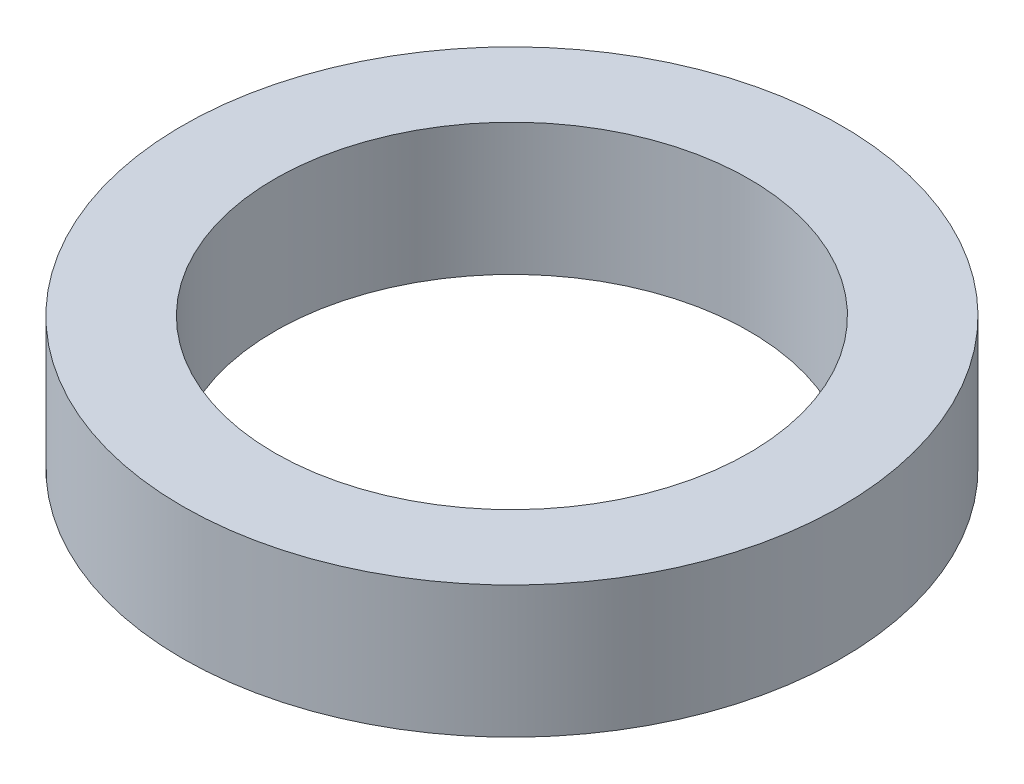
ISO-10303-21;
HEADER;
FILE_DESCRIPTION(('STEP AP214'),'2;1');
FILE_NAME('part.step','',(''),(''),'','','');
FILE_SCHEMA(('AUTOMOTIVE_DESIGN { 1 0 10303 214 1 1 1 1 }'));
ENDSEC;
DATA;
#1=APPLICATION_CONTEXT('core data for automotive mechanical design processes');
#2=APPLICATION_PROTOCOL_DEFINITION('international standard','automotive_design',2000,#1);
#3=PRODUCT_CONTEXT('',#1,'mechanical');
#4=PRODUCT('Part','Part','',(#3));
#5=PRODUCT_RELATED_PRODUCT_CATEGORY('part','',(#4));
#6=PRODUCT_DEFINITION_FORMATION('','',#4);
#7=PRODUCT_DEFINITION_CONTEXT('part definition',#1,'design');
#8=PRODUCT_DEFINITION('design','',#6,#7);
#9=PRODUCT_DEFINITION_SHAPE('','',#8);
#10=(LENGTH_UNIT() NAMED_UNIT(*) SI_UNIT(.MILLI.,.METRE.));
#11=(NAMED_UNIT(*) PLANE_ANGLE_UNIT() SI_UNIT($,.RADIAN.));
#12=(NAMED_UNIT(*) SI_UNIT($,.STERADIAN.) SOLID_ANGLE_UNIT());
#13=UNCERTAINTY_MEASURE_WITH_UNIT(LENGTH_MEASURE(1.E-05),#10,'distance_accuracy_value','');
#14=(GEOMETRIC_REPRESENTATION_CONTEXT(3) GLOBAL_UNCERTAINTY_ASSIGNED_CONTEXT((#13)) GLOBAL_UNIT_ASSIGNED_CONTEXT((#10,
#11,#12)) REPRESENTATION_CONTEXT('',''));
#15=CARTESIAN_POINT('',(0.,0.,0.));
#16=DIRECTION('',(0.,0.,1.));
#17=DIRECTION('',(1.,0.,0.));
#18=AXIS2_PLACEMENT_3D('',#15,#16,#17);
#19=CARTESIAN_POINT('',(0.,20.,0.));
#20=DIRECTION('',(0.,1.,0.));
#21=DIRECTION('',(0.,0.,1.));
#22=AXIS2_PLACEMENT_3D('',#19,#20,#21);
#23=PLANE('',#22);
#24=CARTESIAN_POINT('',(0.,20.,0.));
#25=DIRECTION('',(0.,1.,0.));
#26=DIRECTION('',(0.,0.,1.));
#27=AXIS2_PLACEMENT_3D('',#24,#25,#26);
#28=CIRCLE('',#27,36.);
#29=CARTESIAN_POINT('',(0.,20.,36.));
#30=VERTEX_POINT('',#29);
#31=EDGE_CURVE('E27',#30,#30,#28,.F.);
#32=ORIENTED_EDGE('',*,*,#31,.T.);
#33=EDGE_LOOP('',(#32));
#34=FACE_BOUND('',#33,.T.);
#35=CARTESIAN_POINT('',(0.,20.,0.));
#36=DIRECTION('',(0.,1.,0.));
#37=DIRECTION('',(0.,0.,1.));
#38=AXIS2_PLACEMENT_3D('',#35,#36,#37);
#39=CIRCLE('',#38,50.);
#40=CARTESIAN_POINT('',(0.,20.,50.));
#41=VERTEX_POINT('',#40);
#42=EDGE_CURVE('E18',#41,#41,#39,.F.);
#43=ORIENTED_EDGE('',*,*,#42,.F.);
#44=EDGE_LOOP('',(#43));
#45=FACE_BOUND('',#44,.T.);
#46=ADVANCED_FACE('F15',(#34,#45),#23,.T.);
#47=CARTESIAN_POINT('',(0.,0.,0.));
#48=DIRECTION('',(0.,1.,0.));
#49=DIRECTION('',(0.,0.,1.));
#50=AXIS2_PLACEMENT_3D('',#47,#48,#49);
#51=CYLINDRICAL_SURFACE('',#50,50.);
#52=ORIENTED_EDGE('',*,*,#42,.T.);
#53=EDGE_LOOP('',(#52));
#54=FACE_BOUND('',#53,.T.);
#55=CARTESIAN_POINT('',(0.,0.,0.));
#56=DIRECTION('',(0.,1.,0.));
#57=DIRECTION('',(0.,0.,1.));
#58=AXIS2_PLACEMENT_3D('',#55,#56,#57);
#59=CIRCLE('',#58,50.);
#60=CARTESIAN_POINT('',(0.,0.,50.));
#61=VERTEX_POINT('',#60);
#62=EDGE_CURVE('E22',#61,#61,#59,.T.);
#63=ORIENTED_EDGE('',*,*,#62,.T.);
#64=EDGE_LOOP('',(#63));
#65=FACE_BOUND('',#64,.T.);
#66=ADVANCED_FACE('F35',(#54,#65),#51,.T.);
#67=CARTESIAN_POINT('',(0.,0.,0.));
#68=DIRECTION('',(0.,1.,0.));
#69=DIRECTION('',(0.,0.,1.));
#70=AXIS2_PLACEMENT_3D('',#67,#68,#69);
#71=CYLINDRICAL_SURFACE('',#70,36.);
#72=ORIENTED_EDGE('',*,*,#31,.F.);
#73=EDGE_LOOP('',(#72));
#74=FACE_BOUND('',#73,.T.);
#75=CARTESIAN_POINT('',(0.,0.,0.));
#76=DIRECTION('',(0.,1.,0.));
#77=DIRECTION('',(0.,0.,1.));
#78=AXIS2_PLACEMENT_3D('',#75,#76,#77);
#79=CIRCLE('',#78,36.);
#80=CARTESIAN_POINT('',(0.,0.,36.));
#81=VERTEX_POINT('',#80);
#82=EDGE_CURVE('E10',#81,#81,#79,.F.);
#83=ORIENTED_EDGE('',*,*,#82,.T.);
#84=EDGE_LOOP('',(#83));
#85=FACE_BOUND('',#84,.T.);
#86=ADVANCED_FACE('F43',(#74,#85),#71,.F.);
#87=CARTESIAN_POINT('',(0.,0.,0.));
#88=DIRECTION('',(0.,1.,0.));
#89=DIRECTION('',(0.,0.,1.));
#90=AXIS2_PLACEMENT_3D('',#87,#88,#89);
#91=PLANE('',#90);
#92=ORIENTED_EDGE('',*,*,#82,.F.);
#93=EDGE_LOOP('',(#92));
#94=FACE_BOUND('',#93,.T.);
#95=ORIENTED_EDGE('',*,*,#62,.F.);
#96=EDGE_LOOP('',(#95));
#97=FACE_BOUND('',#96,.T.);
#98=ADVANCED_FACE('F44',(#94,#97),#91,.F.);
#99=CLOSED_SHELL('',(#46,#66,#86,#98));
#100=MANIFOLD_SOLID_BREP('B1',#99);
#101=ADVANCED_BREP_SHAPE_REPRESENTATION('',(#18,#100),#14);
#102=SHAPE_DEFINITION_REPRESENTATION(#9,#101);
ENDSEC;
END-ISO-10303-21;
